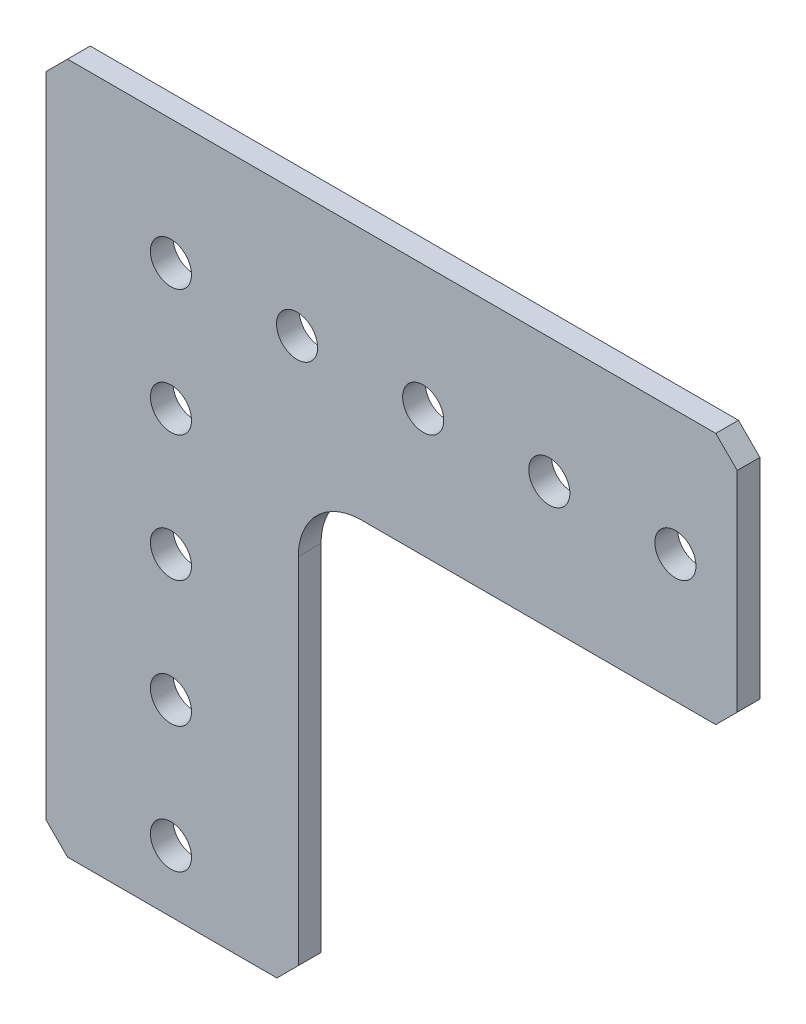
ISO-10303-21;
HEADER;
FILE_DESCRIPTION(('STEP AP214'),'2;1');
FILE_NAME('part.step','',(''),(''),'','','');
FILE_SCHEMA(('AUTOMOTIVE_DESIGN { 1 0 10303 214 1 1 1 1 }'));
ENDSEC;
DATA;
#1=APPLICATION_CONTEXT('core data for automotive mechanical design processes');
#2=APPLICATION_PROTOCOL_DEFINITION('international standard','automotive_design',2000,#1);
#3=PRODUCT_CONTEXT('',#1,'mechanical');
#4=PRODUCT('Part','Part','',(#3));
#5=PRODUCT_RELATED_PRODUCT_CATEGORY('part','',(#4));
#6=PRODUCT_DEFINITION_FORMATION('','',#4);
#7=PRODUCT_DEFINITION_CONTEXT('part definition',#1,'design');
#8=PRODUCT_DEFINITION('design','',#6,#7);
#9=PRODUCT_DEFINITION_SHAPE('','',#8);
#10=(LENGTH_UNIT() NAMED_UNIT(*) SI_UNIT(.MILLI.,.METRE.));
#11=(NAMED_UNIT(*) PLANE_ANGLE_UNIT() SI_UNIT($,.RADIAN.));
#12=(NAMED_UNIT(*) SI_UNIT($,.STERADIAN.) SOLID_ANGLE_UNIT());
#13=UNCERTAINTY_MEASURE_WITH_UNIT(LENGTH_MEASURE(1.E-05),#10,'distance_accuracy_value','');
#14=(GEOMETRIC_REPRESENTATION_CONTEXT(3) GLOBAL_UNCERTAINTY_ASSIGNED_CONTEXT((#13)) GLOBAL_UNIT_ASSIGNED_CONTEXT((#10,
#11,#12)) REPRESENTATION_CONTEXT('',''));
#15=CARTESIAN_POINT('',(0.,0.,0.));
#16=DIRECTION('',(0.,0.,1.));
#17=DIRECTION('',(1.,0.,0.));
#18=AXIS2_PLACEMENT_3D('',#15,#16,#17);
#19=CARTESIAN_POINT('',(-12.573,12.573,0.));
#20=DIRECTION('',(0.,0.,-1.));
#21=DIRECTION('',(-1.,0.,0.));
#22=AXIS2_PLACEMENT_3D('',#19,#20,#21);
#23=PLANE('',#22);
#24=DIRECTION('',(1.,0.,0.));
#25=VECTOR('',#24,1.);
#26=CARTESIAN_POINT('',(-12.573,12.573,0.));
#27=LINE('',#26,#25);
#28=CARTESIAN_POINT('',(-10.414,12.573,0.));
#29=VERTEX_POINT('',#28);
#30=CARTESIAN_POINT('',(54.864,12.573,0.));
#31=VERTEX_POINT('',#30);
#32=EDGE_CURVE('E144',#29,#31,#27,.T.);
#33=ORIENTED_EDGE('',*,*,#32,.T.);
#34=DIRECTION('',(0.707106781186549,-0.707106781186546,0.));
#35=VECTOR('',#34,1.);
#36=CARTESIAN_POINT('',(54.864,12.573,0.));
#37=LINE('',#36,#35);
#38=CARTESIAN_POINT('',(57.023,10.414,0.));
#39=VERTEX_POINT('',#38);
#40=EDGE_CURVE('E139',#31,#39,#37,.T.);
#41=ORIENTED_EDGE('',*,*,#40,.T.);
#42=DIRECTION('',(0.,-1.,0.));
#43=VECTOR('',#42,1.);
#44=CARTESIAN_POINT('',(57.023,12.573,0.));
#45=LINE('',#44,#43);
#46=CARTESIAN_POINT('',(57.023,-10.668,0.));
#47=VERTEX_POINT('',#46);
#48=EDGE_CURVE('E132',#39,#47,#45,.T.);
#49=ORIENTED_EDGE('',*,*,#48,.T.);
#50=DIRECTION('',(0.707106781186547,0.707106781186548,0.));
#51=VECTOR('',#50,1.);
#52=CARTESIAN_POINT('',(57.023,-10.668,0.));
#53=LINE('',#52,#51);
#54=CARTESIAN_POINT('',(54.864,-12.827,0.));
#55=VERTEX_POINT('',#54);
#56=EDGE_CURVE('E121',#55,#47,#53,.T.);
#57=ORIENTED_EDGE('',*,*,#56,.F.);
#58=DIRECTION('',(1.,0.,0.));
#59=VECTOR('',#58,1.);
#60=CARTESIAN_POINT('',(0.,-12.827,0.));
#61=LINE('',#60,#59);
#62=CARTESIAN_POINT('',(19.177,-12.827,0.));
#63=VERTEX_POINT('',#62);
#64=EDGE_CURVE('E115',#63,#55,#61,.T.);
#65=ORIENTED_EDGE('',*,*,#64,.F.);
#66=CARTESIAN_POINT('',(19.177,-19.177,0.));
#67=DIRECTION('',(0.,0.,1.));
#68=DIRECTION('',(1.,0.,0.));
#69=AXIS2_PLACEMENT_3D('',#66,#67,#68);
#70=CIRCLE('',#69,6.35);
#71=CARTESIAN_POINT('',(12.827,-19.177,0.));
#72=VERTEX_POINT('',#71);
#73=EDGE_CURVE('E103',#63,#72,#70,.T.);
#74=ORIENTED_EDGE('',*,*,#73,.T.);
#75=DIRECTION('',(0.,-1.,0.));
#76=VECTOR('',#75,1.);
#77=CARTESIAN_POINT('',(12.827,0.,0.));
#78=LINE('',#77,#76);
#79=CARTESIAN_POINT('',(12.827,-54.864,0.));
#80=VERTEX_POINT('',#79);
#81=EDGE_CURVE('E174',#72,#80,#78,.T.);
#82=ORIENTED_EDGE('',*,*,#81,.T.);
#83=DIRECTION('',(-0.707106781186547,-0.707106781186548,0.));
#84=VECTOR('',#83,1.);
#85=CARTESIAN_POINT('',(12.827,-54.864,0.));
#86=LINE('',#85,#84);
#87=CARTESIAN_POINT('',(10.668,-57.023,0.));
#88=VERTEX_POINT('',#87);
#89=EDGE_CURVE('E169',#80,#88,#86,.T.);
#90=ORIENTED_EDGE('',*,*,#89,.T.);
#91=DIRECTION('',(-1.,0.,0.));
#92=VECTOR('',#91,1.);
#93=CARTESIAN_POINT('',(12.827,-57.023,0.));
#94=LINE('',#93,#92);
#95=CARTESIAN_POINT('',(-10.414,-57.023,0.));
#96=VERTEX_POINT('',#95);
#97=EDGE_CURVE('E164',#88,#96,#94,.T.);
#98=ORIENTED_EDGE('',*,*,#97,.T.);
#99=DIRECTION('',(-0.707106781186548,0.707106781186548,0.));
#100=VECTOR('',#99,1.);
#101=CARTESIAN_POINT('',(-10.414,-57.023,0.));
#102=LINE('',#101,#100);
#103=CARTESIAN_POINT('',(-12.573,-54.864,0.));
#104=VERTEX_POINT('',#103);
#105=EDGE_CURVE('E159',#96,#104,#102,.T.);
#106=ORIENTED_EDGE('',*,*,#105,.T.);
#107=DIRECTION('',(0.,1.,0.));
#108=VECTOR('',#107,1.);
#109=CARTESIAN_POINT('',(-12.573,-57.023,0.));
#110=LINE('',#109,#108);
#111=CARTESIAN_POINT('',(-12.573,10.414,0.));
#112=VERTEX_POINT('',#111);
#113=EDGE_CURVE('E154',#104,#112,#110,.T.);
#114=ORIENTED_EDGE('',*,*,#113,.T.);
#115=DIRECTION('',(0.707106781186548,0.707106781186548,0.));
#116=VECTOR('',#115,1.);
#117=CARTESIAN_POINT('',(-12.573,10.414,0.));
#118=LINE('',#117,#116);
#119=EDGE_CURVE('E149',#112,#29,#118,.T.);
#120=ORIENTED_EDGE('',*,*,#119,.T.);
#121=EDGE_LOOP('',(#33,#41,#49,#57,#65,#74,#82,#90,#98,#106,#114,#120));
#122=FACE_BOUND('',#121,.T.);
#123=CARTESIAN_POINT('',(0.,-50.8,0.));
#124=DIRECTION('',(0.,0.,-1.));
#125=DIRECTION('',(-1.,0.,0.));
#126=AXIS2_PLACEMENT_3D('',#123,#124,#125);
#127=CIRCLE('',#126,2.0701);
#128=CARTESIAN_POINT('',(-2.07009999999999,-50.8,0.));
#129=VERTEX_POINT('',#128);
#130=EDGE_CURVE('E112',#129,#129,#127,.F.);
#131=ORIENTED_EDGE('',*,*,#130,.T.);
#132=EDGE_LOOP('',(#131));
#133=FACE_BOUND('',#132,.T.);
#134=CARTESIAN_POINT('',(2.66050878019847E-13,-25.4,0.));
#135=DIRECTION('',(0.,0.,-1.));
#136=DIRECTION('',(-1.,0.,0.));
#137=AXIS2_PLACEMENT_3D('',#134,#135,#136);
#138=CIRCLE('',#137,2.0701);
#139=CARTESIAN_POINT('',(-2.07009999999973,-25.4,0.));
#140=VERTEX_POINT('',#139);
#141=EDGE_CURVE('E209',#140,#140,#138,.F.);
#142=ORIENTED_EDGE('',*,*,#141,.T.);
#143=EDGE_LOOP('',(#142));
#144=FACE_BOUND('',#143,.T.);
#145=CARTESIAN_POINT('',(38.1,0.,0.));
#146=DIRECTION('',(0.,0.,-1.));
#147=DIRECTION('',(-1.,0.,0.));
#148=AXIS2_PLACEMENT_3D('',#145,#146,#147);
#149=CIRCLE('',#148,2.0701);
#150=CARTESIAN_POINT('',(36.0299,0.,0.));
#151=VERTEX_POINT('',#150);
#152=EDGE_CURVE('E212',#151,#151,#149,.F.);
#153=ORIENTED_EDGE('',*,*,#152,.T.);
#154=EDGE_LOOP('',(#153));
#155=FACE_BOUND('',#154,.T.);
#156=CARTESIAN_POINT('',(12.7,1.77367252013231E-13,0.));
#157=DIRECTION('',(0.,0.,-1.));
#158=DIRECTION('',(-1.,0.,0.));
#159=AXIS2_PLACEMENT_3D('',#156,#157,#158);
#160=CIRCLE('',#159,2.0701);
#161=CARTESIAN_POINT('',(10.6299,1.77367252013231E-13,0.));
#162=VERTEX_POINT('',#161);
#163=EDGE_CURVE('E215',#162,#162,#160,.F.);
#164=ORIENTED_EDGE('',*,*,#163,.T.);
#165=EDGE_LOOP('',(#164));
#166=FACE_BOUND('',#165,.T.);
#167=CARTESIAN_POINT('',(0.,0.,0.));
#168=DIRECTION('',(0.,0.,-1.));
#169=DIRECTION('',(-1.,0.,0.));
#170=AXIS2_PLACEMENT_3D('',#167,#168,#169);
#171=CIRCLE('',#170,2.0701);
#172=CARTESIAN_POINT('',(-2.0701,0.,0.));
#173=VERTEX_POINT('',#172);
#174=EDGE_CURVE('E218',#173,#173,#171,.F.);
#175=ORIENTED_EDGE('',*,*,#174,.T.);
#176=EDGE_LOOP('',(#175));
#177=FACE_BOUND('',#176,.T.);
#178=CARTESIAN_POINT('',(25.4,3.54734504026462E-13,0.));
#179=DIRECTION('',(0.,0.,-1.));
#180=DIRECTION('',(-1.,0.,0.));
#181=AXIS2_PLACEMENT_3D('',#178,#179,#180);
#182=CIRCLE('',#181,2.0701);
#183=CARTESIAN_POINT('',(23.3299,3.54734504026462E-13,0.));
#184=VERTEX_POINT('',#183);
#185=EDGE_CURVE('E221',#184,#184,#182,.F.);
#186=ORIENTED_EDGE('',*,*,#185,.T.);
#187=EDGE_LOOP('',(#186));
#188=FACE_BOUND('',#187,.T.);
#189=CARTESIAN_POINT('',(1.33025439009923E-13,-12.7,0.));
#190=DIRECTION('',(0.,0.,-1.));
#191=DIRECTION('',(-1.,0.,0.));
#192=AXIS2_PLACEMENT_3D('',#189,#190,#191);
#193=CIRCLE('',#192,2.0701);
#194=CARTESIAN_POINT('',(-2.07009999999987,-12.7,0.));
#195=VERTEX_POINT('',#194);
#196=EDGE_CURVE('E224',#195,#195,#193,.F.);
#197=ORIENTED_EDGE('',*,*,#196,.T.);
#198=EDGE_LOOP('',(#197));
#199=FACE_BOUND('',#198,.T.);
#200=CARTESIAN_POINT('',(3.9907631702977E-13,-38.1,0.));
#201=DIRECTION('',(0.,0.,-1.));
#202=DIRECTION('',(-1.,0.,0.));
#203=AXIS2_PLACEMENT_3D('',#200,#201,#202);
#204=CIRCLE('',#203,2.0701);
#205=CARTESIAN_POINT('',(-2.0700999999996,-38.1,0.));
#206=VERTEX_POINT('',#205);
#207=EDGE_CURVE('E226',#206,#206,#204,.F.);
#208=ORIENTED_EDGE('',*,*,#207,.T.);
#209=EDGE_LOOP('',(#208));
#210=FACE_BOUND('',#209,.T.);
#211=CARTESIAN_POINT('',(50.8,0.,0.));
#212=DIRECTION('',(0.,0.,-1.));
#213=DIRECTION('',(-1.,0.,0.));
#214=AXIS2_PLACEMENT_3D('',#211,#212,#213);
#215=CIRCLE('',#214,2.0701);
#216=CARTESIAN_POINT('',(48.7299,0.,0.));
#217=VERTEX_POINT('',#216);
#218=EDGE_CURVE('E20',#217,#217,#215,.F.);
#219=ORIENTED_EDGE('',*,*,#218,.T.);
#220=EDGE_LOOP('',(#219));
#221=FACE_BOUND('',#220,.T.);
#222=ADVANCED_FACE('F17',(#122,#133,#144,#155,#166,#177,#188,#199,#210,#221),#23,.T.);
#223=CARTESIAN_POINT('',(50.8,0.,2.286));
#224=DIRECTION('',(0.,0.,-1.));
#225=DIRECTION('',(-1.,0.,0.));
#226=AXIS2_PLACEMENT_3D('',#223,#224,#225);
#227=CYLINDRICAL_SURFACE('',#226,2.0701);
#228=ORIENTED_EDGE('',*,*,#218,.F.);
#229=EDGE_LOOP('',(#228));
#230=FACE_BOUND('',#229,.T.);
#231=CARTESIAN_POINT('',(50.8,0.,2.286));
#232=DIRECTION('',(0.,0.,-1.));
#233=DIRECTION('',(-1.,0.,0.));
#234=AXIS2_PLACEMENT_3D('',#231,#232,#233);
#235=CIRCLE('',#234,2.0701);
#236=CARTESIAN_POINT('',(48.7299,0.,2.286));
#237=VERTEX_POINT('',#236);
#238=EDGE_CURVE('E117',#237,#237,#235,.F.);
#239=ORIENTED_EDGE('',*,*,#238,.T.);
#240=EDGE_LOOP('',(#239));
#241=FACE_BOUND('',#240,.T.);
#242=ADVANCED_FACE('F234',(#230,#241),#227,.F.);
#243=CARTESIAN_POINT('',(3.9907631702977E-13,-38.1,2.286));
#244=DIRECTION('',(0.,0.,-1.));
#245=DIRECTION('',(-1.,0.,0.));
#246=AXIS2_PLACEMENT_3D('',#243,#244,#245);
#247=CYLINDRICAL_SURFACE('',#246,2.0701);
#248=ORIENTED_EDGE('',*,*,#207,.F.);
#249=EDGE_LOOP('',(#248));
#250=FACE_BOUND('',#249,.T.);
#251=CARTESIAN_POINT('',(3.9907631702977E-13,-38.1,2.286));
#252=DIRECTION('',(0.,0.,-1.));
#253=DIRECTION('',(-1.,0.,0.));
#254=AXIS2_PLACEMENT_3D('',#251,#252,#253);
#255=CIRCLE('',#254,2.0701);
#256=CARTESIAN_POINT('',(-2.0700999999996,-38.1,2.286));
#257=VERTEX_POINT('',#256);
#258=EDGE_CURVE('E202',#257,#257,#255,.F.);
#259=ORIENTED_EDGE('',*,*,#258,.T.);
#260=EDGE_LOOP('',(#259));
#261=FACE_BOUND('',#260,.T.);
#262=ADVANCED_FACE('F237',(#250,#261),#247,.F.);
#263=CARTESIAN_POINT('',(1.33025439009923E-13,-12.7,2.286));
#264=DIRECTION('',(0.,0.,-1.));
#265=DIRECTION('',(-1.,0.,0.));
#266=AXIS2_PLACEMENT_3D('',#263,#264,#265);
#267=CYLINDRICAL_SURFACE('',#266,2.0701);
#268=ORIENTED_EDGE('',*,*,#196,.F.);
#269=EDGE_LOOP('',(#268));
#270=FACE_BOUND('',#269,.T.);
#271=CARTESIAN_POINT('',(1.33025439009923E-13,-12.7,2.286));
#272=DIRECTION('',(0.,0.,-1.));
#273=DIRECTION('',(-1.,0.,0.));
#274=AXIS2_PLACEMENT_3D('',#271,#272,#273);
#275=CIRCLE('',#274,2.0701);
#276=CARTESIAN_POINT('',(-2.07009999999987,-12.7,2.286));
#277=VERTEX_POINT('',#276);
#278=EDGE_CURVE('E199',#277,#277,#275,.F.);
#279=ORIENTED_EDGE('',*,*,#278,.T.);
#280=EDGE_LOOP('',(#279));
#281=FACE_BOUND('',#280,.T.);
#282=ADVANCED_FACE('F317',(#270,#281),#267,.F.);
#283=CARTESIAN_POINT('',(25.4,3.54734504026462E-13,2.286));
#284=DIRECTION('',(0.,0.,-1.));
#285=DIRECTION('',(-1.,0.,0.));
#286=AXIS2_PLACEMENT_3D('',#283,#284,#285);
#287=CYLINDRICAL_SURFACE('',#286,2.0701);
#288=ORIENTED_EDGE('',*,*,#185,.F.);
#289=EDGE_LOOP('',(#288));
#290=FACE_BOUND('',#289,.T.);
#291=CARTESIAN_POINT('',(25.4,3.54734504026462E-13,2.286));
#292=DIRECTION('',(0.,0.,-1.));
#293=DIRECTION('',(-1.,0.,0.));
#294=AXIS2_PLACEMENT_3D('',#291,#292,#293);
#295=CIRCLE('',#294,2.0701);
#296=CARTESIAN_POINT('',(23.3299,3.54734504026462E-13,2.286));
#297=VERTEX_POINT('',#296);
#298=EDGE_CURVE('E196',#297,#297,#295,.F.);
#299=ORIENTED_EDGE('',*,*,#298,.T.);
#300=EDGE_LOOP('',(#299));
#301=FACE_BOUND('',#300,.T.);
#302=ADVANCED_FACE('F313',(#290,#301),#287,.F.);
#303=CARTESIAN_POINT('',(0.,0.,2.286));
#304=DIRECTION('',(0.,0.,-1.));
#305=DIRECTION('',(-1.,0.,0.));
#306=AXIS2_PLACEMENT_3D('',#303,#304,#305);
#307=CYLINDRICAL_SURFACE('',#306,2.0701);
#308=ORIENTED_EDGE('',*,*,#174,.F.);
#309=EDGE_LOOP('',(#308));
#310=FACE_BOUND('',#309,.T.);
#311=CARTESIAN_POINT('',(0.,0.,2.286));
#312=DIRECTION('',(0.,0.,-1.));
#313=DIRECTION('',(-1.,0.,0.));
#314=AXIS2_PLACEMENT_3D('',#311,#312,#313);
#315=CIRCLE('',#314,2.0701);
#316=CARTESIAN_POINT('',(-2.0701,0.,2.286));
#317=VERTEX_POINT('',#316);
#318=EDGE_CURVE('E193',#317,#317,#315,.F.);
#319=ORIENTED_EDGE('',*,*,#318,.T.);
#320=EDGE_LOOP('',(#319));
#321=FACE_BOUND('',#320,.T.);
#322=ADVANCED_FACE('F309',(#310,#321),#307,.F.);
#323=CARTESIAN_POINT('',(12.7,1.77367252013231E-13,2.286));
#324=DIRECTION('',(0.,0.,-1.));
#325=DIRECTION('',(-1.,0.,0.));
#326=AXIS2_PLACEMENT_3D('',#323,#324,#325);
#327=CYLINDRICAL_SURFACE('',#326,2.0701);
#328=ORIENTED_EDGE('',*,*,#163,.F.);
#329=EDGE_LOOP('',(#328));
#330=FACE_BOUND('',#329,.T.);
#331=CARTESIAN_POINT('',(12.7,1.77367252013231E-13,2.286));
#332=DIRECTION('',(0.,0.,-1.));
#333=DIRECTION('',(-1.,0.,0.));
#334=AXIS2_PLACEMENT_3D('',#331,#332,#333);
#335=CIRCLE('',#334,2.0701);
#336=CARTESIAN_POINT('',(10.6299,1.77367252013231E-13,2.286));
#337=VERTEX_POINT('',#336);
#338=EDGE_CURVE('E190',#337,#337,#335,.F.);
#339=ORIENTED_EDGE('',*,*,#338,.T.);
#340=EDGE_LOOP('',(#339));
#341=FACE_BOUND('',#340,.T.);
#342=ADVANCED_FACE('F305',(#330,#341),#327,.F.);
#343=CARTESIAN_POINT('',(38.1,0.,2.286));
#344=DIRECTION('',(0.,0.,-1.));
#345=DIRECTION('',(-1.,0.,0.));
#346=AXIS2_PLACEMENT_3D('',#343,#344,#345);
#347=CYLINDRICAL_SURFACE('',#346,2.0701);
#348=ORIENTED_EDGE('',*,*,#152,.F.);
#349=EDGE_LOOP('',(#348));
#350=FACE_BOUND('',#349,.T.);
#351=CARTESIAN_POINT('',(38.1,0.,2.286));
#352=DIRECTION('',(0.,0.,-1.));
#353=DIRECTION('',(-1.,0.,0.));
#354=AXIS2_PLACEMENT_3D('',#351,#352,#353);
#355=CIRCLE('',#354,2.0701);
#356=CARTESIAN_POINT('',(36.0299,0.,2.286));
#357=VERTEX_POINT('',#356);
#358=EDGE_CURVE('E187',#357,#357,#355,.F.);
#359=ORIENTED_EDGE('',*,*,#358,.T.);
#360=EDGE_LOOP('',(#359));
#361=FACE_BOUND('',#360,.T.);
#362=ADVANCED_FACE('F301',(#350,#361),#347,.F.);
#363=CARTESIAN_POINT('',(2.66050878019847E-13,-25.4,2.286));
#364=DIRECTION('',(0.,0.,-1.));
#365=DIRECTION('',(-1.,0.,0.));
#366=AXIS2_PLACEMENT_3D('',#363,#364,#365);
#367=CYLINDRICAL_SURFACE('',#366,2.0701);
#368=ORIENTED_EDGE('',*,*,#141,.F.);
#369=EDGE_LOOP('',(#368));
#370=FACE_BOUND('',#369,.T.);
#371=CARTESIAN_POINT('',(2.66050878019847E-13,-25.4,2.286));
#372=DIRECTION('',(0.,0.,-1.));
#373=DIRECTION('',(-1.,0.,0.));
#374=AXIS2_PLACEMENT_3D('',#371,#372,#373);
#375=CIRCLE('',#374,2.0701);
#376=CARTESIAN_POINT('',(-2.07009999999973,-25.4,2.286));
#377=VERTEX_POINT('',#376);
#378=EDGE_CURVE('E184',#377,#377,#375,.F.);
#379=ORIENTED_EDGE('',*,*,#378,.T.);
#380=EDGE_LOOP('',(#379));
#381=FACE_BOUND('',#380,.T.);
#382=ADVANCED_FACE('F297',(#370,#381),#367,.F.);
#383=CARTESIAN_POINT('',(0.,-50.8,2.286));
#384=DIRECTION('',(0.,0.,-1.));
#385=DIRECTION('',(-1.,0.,0.));
#386=AXIS2_PLACEMENT_3D('',#383,#384,#385);
#387=CYLINDRICAL_SURFACE('',#386,2.0701);
#388=ORIENTED_EDGE('',*,*,#130,.F.);
#389=EDGE_LOOP('',(#388));
#390=FACE_BOUND('',#389,.T.);
#391=CARTESIAN_POINT('',(0.,-50.8,2.286));
#392=DIRECTION('',(0.,0.,-1.));
#393=DIRECTION('',(-1.,0.,0.));
#394=AXIS2_PLACEMENT_3D('',#391,#392,#393);
#395=CIRCLE('',#394,2.0701);
#396=CARTESIAN_POINT('',(-2.07009999999999,-50.8,2.286));
#397=VERTEX_POINT('',#396);
#398=EDGE_CURVE('E181',#397,#397,#395,.F.);
#399=ORIENTED_EDGE('',*,*,#398,.T.);
#400=EDGE_LOOP('',(#399));
#401=FACE_BOUND('',#400,.T.);
#402=ADVANCED_FACE('F294',(#390,#401),#387,.F.);
#403=CARTESIAN_POINT('',(19.177,-19.177,0.));
#404=DIRECTION('',(0.,0.,1.));
#405=DIRECTION('',(1.,0.,0.));
#406=AXIS2_PLACEMENT_3D('',#403,#404,#405);
#407=CYLINDRICAL_SURFACE('',#406,6.35);
#408=DIRECTION('',(0.,0.,1.));
#409=VECTOR('',#408,1.);
#410=CARTESIAN_POINT('',(12.827,-19.177,0.));
#411=LINE('',#410,#409);
#412=CARTESIAN_POINT('',(12.827,-19.177,2.286));
#413=VERTEX_POINT('',#412);
#414=EDGE_CURVE('E108',#413,#72,#411,.F.);
#415=ORIENTED_EDGE('',*,*,#414,.T.);
#416=ORIENTED_EDGE('',*,*,#73,.F.);
#417=DIRECTION('',(0.,0.,-1.));
#418=VECTOR('',#417,1.);
#419=CARTESIAN_POINT('',(19.177,-12.827,0.));
#420=LINE('',#419,#418);
#421=CARTESIAN_POINT('',(19.177,-12.827,2.286));
#422=VERTEX_POINT('',#421);
#423=EDGE_CURVE('E107',#422,#63,#420,.T.);
#424=ORIENTED_EDGE('',*,*,#423,.F.);
#425=CARTESIAN_POINT('',(19.177,-19.177,2.286));
#426=DIRECTION('',(0.,0.,1.));
#427=DIRECTION('',(1.,0.,0.));
#428=AXIS2_PLACEMENT_3D('',#425,#426,#427);
#429=CIRCLE('',#428,6.35);
#430=EDGE_CURVE('E178',#422,#413,#429,.T.);
#431=ORIENTED_EDGE('',*,*,#430,.T.);
#432=EDGE_LOOP('',(#415,#416,#424,#431));
#433=FACE_BOUND('',#432,.T.);
#434=ADVANCED_FACE('F105',(#433),#407,.F.);
#435=CARTESIAN_POINT('',(12.827,0.,0.));
#436=DIRECTION('',(-1.,0.,0.));
#437=DIRECTION('',(0.,-1.,0.));
#438=AXIS2_PLACEMENT_3D('',#435,#436,#437);
#439=PLANE('',#438);
#440=DIRECTION('',(0.,0.,1.));
#441=VECTOR('',#440,1.);
#442=CARTESIAN_POINT('',(12.827,-54.864,0.));
#443=LINE('',#442,#441);
#444=CARTESIAN_POINT('',(12.827,-54.864,2.286));
#445=VERTEX_POINT('',#444);
#446=EDGE_CURVE('E171',#445,#80,#443,.F.);
#447=ORIENTED_EDGE('',*,*,#446,.T.);
#448=ORIENTED_EDGE('',*,*,#81,.F.);
#449=ORIENTED_EDGE('',*,*,#414,.F.);
#450=DIRECTION('',(0.,1.,0.));
#451=VECTOR('',#450,1.);
#452=CARTESIAN_POINT('',(12.827,12.573,2.286));
#453=LINE('',#452,#451);
#454=EDGE_CURVE('E180',#413,#445,#453,.F.);
#455=ORIENTED_EDGE('',*,*,#454,.T.);
#456=EDGE_LOOP('',(#447,#448,#449,#455));
#457=FACE_BOUND('',#456,.T.);
#458=ADVANCED_FACE('F287',(#457),#439,.F.);
#459=CARTESIAN_POINT('',(12.827,-54.864,0.));
#460=DIRECTION('',(-0.707106781186548,0.707106781186547,0.));
#461=DIRECTION('',(-0.707106781186547,-0.707106781186548,0.));
#462=AXIS2_PLACEMENT_3D('',#459,#460,#461);
#463=PLANE('',#462);
#464=DIRECTION('',(0.,0.,1.));
#465=VECTOR('',#464,1.);
#466=CARTESIAN_POINT('',(10.668,-57.023,2.286));
#467=LINE('',#466,#465);
#468=CARTESIAN_POINT('',(10.668,-57.023,2.286));
#469=VERTEX_POINT('',#468);
#470=EDGE_CURVE('E166',#469,#88,#467,.F.);
#471=ORIENTED_EDGE('',*,*,#470,.T.);
#472=ORIENTED_EDGE('',*,*,#89,.F.);
#473=ORIENTED_EDGE('',*,*,#446,.F.);
#474=DIRECTION('',(-0.70710678118655,-0.707106781186545,0.));
#475=VECTOR('',#474,1.);
#476=CARTESIAN_POINT('',(12.827,-54.864,2.286));
#477=LINE('',#476,#475);
#478=EDGE_CURVE('E554',#445,#469,#477,.T.);
#479=ORIENTED_EDGE('',*,*,#478,.T.);
#480=EDGE_LOOP('',(#471,#472,#473,#479));
#481=FACE_BOUND('',#480,.T.);
#482=ADVANCED_FACE('F283',(#481),#463,.F.);
#483=CARTESIAN_POINT('',(12.827,-57.023,2.286));
#484=DIRECTION('',(0.,1.,0.));
#485=DIRECTION('',(-1.,0.,0.));
#486=AXIS2_PLACEMENT_3D('',#483,#484,#485);
#487=PLANE('',#486);
#488=ORIENTED_EDGE('',*,*,#470,.F.);
#489=DIRECTION('',(-1.,0.,0.));
#490=VECTOR('',#489,1.);
#491=CARTESIAN_POINT('',(-12.573,-57.023,2.286));
#492=LINE('',#491,#490);
#493=CARTESIAN_POINT('',(-10.414,-57.023,2.286));
#494=VERTEX_POINT('',#493);
#495=EDGE_CURVE('E556',#469,#494,#492,.T.);
#496=ORIENTED_EDGE('',*,*,#495,.T.);
#497=DIRECTION('',(0.,0.,1.));
#498=VECTOR('',#497,1.);
#499=CARTESIAN_POINT('',(-10.414,-57.023,2.286));
#500=LINE('',#499,#498);
#501=EDGE_CURVE('E161',#494,#96,#500,.F.);
#502=ORIENTED_EDGE('',*,*,#501,.T.);
#503=ORIENTED_EDGE('',*,*,#97,.F.);
#504=EDGE_LOOP('',(#488,#496,#502,#503));
#505=FACE_BOUND('',#504,.T.);
#506=ADVANCED_FACE('F279',(#505),#487,.F.);
#507=CARTESIAN_POINT('',(-10.414,-57.023,2.286));
#508=DIRECTION('',(0.707106781186548,0.707106781186548,0.));
#509=DIRECTION('',(-0.707106781186548,0.707106781186548,0.));
#510=AXIS2_PLACEMENT_3D('',#507,#508,#509);
#511=PLANE('',#510);
#512=DIRECTION('',(0.,0.,1.));
#513=VECTOR('',#512,1.);
#514=CARTESIAN_POINT('',(-12.573,-54.864,2.286));
#515=LINE('',#514,#513);
#516=CARTESIAN_POINT('',(-12.573,-54.864,2.286));
#517=VERTEX_POINT('',#516);
#518=EDGE_CURVE('E156',#517,#104,#515,.F.);
#519=ORIENTED_EDGE('',*,*,#518,.T.);
#520=ORIENTED_EDGE('',*,*,#105,.F.);
#521=ORIENTED_EDGE('',*,*,#501,.F.);
#522=DIRECTION('',(-0.707106781186547,0.707106781186548,0.));
#523=VECTOR('',#522,1.);
#524=CARTESIAN_POINT('',(-10.414,-57.023,2.286));
#525=LINE('',#524,#523);
#526=EDGE_CURVE('E565',#494,#517,#525,.T.);
#527=ORIENTED_EDGE('',*,*,#526,.T.);
#528=EDGE_LOOP('',(#519,#520,#521,#527));
#529=FACE_BOUND('',#528,.T.);
#530=ADVANCED_FACE('F275',(#529),#511,.F.);
#531=CARTESIAN_POINT('',(-12.573,-57.023,2.286));
#532=DIRECTION('',(1.,0.,0.));
#533=DIRECTION('',(0.,1.,0.));
#534=AXIS2_PLACEMENT_3D('',#531,#532,#533);
#535=PLANE('',#534);
#536=ORIENTED_EDGE('',*,*,#518,.F.);
#537=DIRECTION('',(0.,1.,0.));
#538=VECTOR('',#537,1.);
#539=CARTESIAN_POINT('',(-12.573,12.573,2.286));
#540=LINE('',#539,#538);
#541=CARTESIAN_POINT('',(-12.573,10.414,2.286));
#542=VERTEX_POINT('',#541);
#543=EDGE_CURVE('E574',#517,#542,#540,.T.);
#544=ORIENTED_EDGE('',*,*,#543,.T.);
#545=DIRECTION('',(0.,0.,1.));
#546=VECTOR('',#545,1.);
#547=CARTESIAN_POINT('',(-12.573,10.414,2.286));
#548=LINE('',#547,#546);
#549=EDGE_CURVE('E151',#542,#112,#548,.F.);
#550=ORIENTED_EDGE('',*,*,#549,.T.);
#551=ORIENTED_EDGE('',*,*,#113,.F.);
#552=EDGE_LOOP('',(#536,#544,#550,#551));
#553=FACE_BOUND('',#552,.T.);
#554=ADVANCED_FACE('F271',(#553),#535,.F.);
#555=CARTESIAN_POINT('',(-12.573,10.414,2.286));
#556=DIRECTION('',(0.707106781186548,-0.707106781186548,0.));
#557=DIRECTION('',(0.707106781186548,0.707106781186548,0.));
#558=AXIS2_PLACEMENT_3D('',#555,#556,#557);
#559=PLANE('',#558);
#560=DIRECTION('',(0.,0.,-1.));
#561=VECTOR('',#560,1.);
#562=CARTESIAN_POINT('',(-10.414,12.573,2.286));
#563=LINE('',#562,#561);
#564=CARTESIAN_POINT('',(-10.414,12.573,2.286));
#565=VERTEX_POINT('',#564);
#566=EDGE_CURVE('E146',#565,#29,#563,.T.);
#567=ORIENTED_EDGE('',*,*,#566,.T.);
#568=ORIENTED_EDGE('',*,*,#119,.F.);
#569=ORIENTED_EDGE('',*,*,#549,.F.);
#570=DIRECTION('',(0.707106781186545,0.70710678118655,0.));
#571=VECTOR('',#570,1.);
#572=CARTESIAN_POINT('',(-12.573,10.414,2.286));
#573=LINE('',#572,#571);
#574=EDGE_CURVE('E583',#542,#565,#573,.T.);
#575=ORIENTED_EDGE('',*,*,#574,.T.);
#576=EDGE_LOOP('',(#567,#568,#569,#575));
#577=FACE_BOUND('',#576,.T.);
#578=ADVANCED_FACE('F267',(#577),#559,.F.);
#579=CARTESIAN_POINT('',(-12.573,12.573,2.286));
#580=DIRECTION('',(0.,-1.,0.));
#581=DIRECTION('',(0.,0.,-1.));
#582=AXIS2_PLACEMENT_3D('',#579,#580,#581);
#583=PLANE('',#582);
#584=ORIENTED_EDGE('',*,*,#566,.F.);
#585=DIRECTION('',(-1.,0.,0.));
#586=VECTOR('',#585,1.);
#587=CARTESIAN_POINT('',(-12.573,12.573,2.286));
#588=LINE('',#587,#586);
#589=CARTESIAN_POINT('',(54.864,12.573,2.286));
#590=VERTEX_POINT('',#589);
#591=EDGE_CURVE('E592',#565,#590,#588,.F.);
#592=ORIENTED_EDGE('',*,*,#591,.T.);
#593=DIRECTION('',(0.,0.,1.));
#594=VECTOR('',#593,1.);
#595=CARTESIAN_POINT('',(54.864,12.573,2.286));
#596=LINE('',#595,#594);
#597=EDGE_CURVE('E141',#590,#31,#596,.F.);
#598=ORIENTED_EDGE('',*,*,#597,.T.);
#599=ORIENTED_EDGE('',*,*,#32,.F.);
#600=EDGE_LOOP('',(#584,#592,#598,#599));
#601=FACE_BOUND('',#600,.T.);
#602=ADVANCED_FACE('F263',(#601),#583,.F.);
#603=CARTESIAN_POINT('',(54.864,12.573,2.286));
#604=DIRECTION('',(-0.707106781186546,-0.707106781186549,0.));
#605=DIRECTION('',(0.707106781186549,-0.707106781186546,0.));
#606=AXIS2_PLACEMENT_3D('',#603,#604,#605);
#607=PLANE('',#606);
#608=DIRECTION('',(0.,0.,1.));
#609=VECTOR('',#608,1.);
#610=CARTESIAN_POINT('',(57.023,10.414,2.286));
#611=LINE('',#610,#609);
#612=CARTESIAN_POINT('',(57.023,10.414,2.286));
#613=VERTEX_POINT('',#612);
#614=EDGE_CURVE('E136',#613,#39,#611,.F.);
#615=ORIENTED_EDGE('',*,*,#614,.T.);
#616=ORIENTED_EDGE('',*,*,#40,.F.);
#617=ORIENTED_EDGE('',*,*,#597,.F.);
#618=DIRECTION('',(0.707106781186551,-0.707106781186544,0.));
#619=VECTOR('',#618,1.);
#620=CARTESIAN_POINT('',(54.864,12.573,2.286));
#621=LINE('',#620,#619);
#622=EDGE_CURVE('E601',#590,#613,#621,.T.);
#623=ORIENTED_EDGE('',*,*,#622,.T.);
#624=EDGE_LOOP('',(#615,#616,#617,#623));
#625=FACE_BOUND('',#624,.T.);
#626=ADVANCED_FACE('F259',(#625),#607,.F.);
#627=CARTESIAN_POINT('',(57.023,12.573,2.286));
#628=DIRECTION('',(-1.,0.,0.));
#629=DIRECTION('',(0.,-1.,0.));
#630=AXIS2_PLACEMENT_3D('',#627,#628,#629);
#631=PLANE('',#630);
#632=DIRECTION('',(0.,0.,1.));
#633=VECTOR('',#632,1.);
#634=CARTESIAN_POINT('',(57.023,-10.668,2.286));
#635=LINE('',#634,#633);
#636=CARTESIAN_POINT('',(57.023,-10.668,2.286));
#637=VERTEX_POINT('',#636);
#638=EDGE_CURVE('E122',#47,#637,#635,.T.);
#639=ORIENTED_EDGE('',*,*,#638,.F.);
#640=ORIENTED_EDGE('',*,*,#48,.F.);
#641=ORIENTED_EDGE('',*,*,#614,.F.);
#642=DIRECTION('',(0.,1.,0.));
#643=VECTOR('',#642,1.);
#644=CARTESIAN_POINT('',(57.023,12.573,2.286));
#645=LINE('',#644,#643);
#646=EDGE_CURVE('E610',#613,#637,#645,.F.);
#647=ORIENTED_EDGE('',*,*,#646,.T.);
#648=EDGE_LOOP('',(#639,#640,#641,#647));
#649=FACE_BOUND('',#648,.T.);
#650=ADVANCED_FACE('F255',(#649),#631,.F.);
#651=CARTESIAN_POINT('',(57.023,-10.668,2.286));
#652=DIRECTION('',(0.707106781186548,-0.707106781186547,0.));
#653=DIRECTION('',(0.707106781186547,0.707106781186548,0.));
#654=AXIS2_PLACEMENT_3D('',#651,#652,#653);
#655=PLANE('',#654);
#656=ORIENTED_EDGE('',*,*,#56,.T.);
#657=ORIENTED_EDGE('',*,*,#638,.T.);
#658=DIRECTION('',(-0.707106781186544,-0.707106781186551,0.));
#659=VECTOR('',#658,1.);
#660=CARTESIAN_POINT('',(57.023,-10.668,2.286));
#661=LINE('',#660,#659);
#662=CARTESIAN_POINT('',(54.864,-12.827,2.286));
#663=VERTEX_POINT('',#662);
#664=EDGE_CURVE('E26',#637,#663,#661,.T.);
#665=ORIENTED_EDGE('',*,*,#664,.T.);
#666=DIRECTION('',(0.,0.,-1.));
#667=VECTOR('',#666,1.);
#668=CARTESIAN_POINT('',(54.864,-12.827,0.));
#669=LINE('',#668,#667);
#670=EDGE_CURVE('E34',#55,#663,#669,.F.);
#671=ORIENTED_EDGE('',*,*,#670,.F.);
#672=EDGE_LOOP('',(#656,#657,#665,#671));
#673=FACE_BOUND('',#672,.T.);
#674=ADVANCED_FACE('F248',(#673),#655,.T.);
#675=CARTESIAN_POINT('',(0.,-12.827,0.));
#676=DIRECTION('',(0.,-1.,0.));
#677=DIRECTION('',(0.,0.,-1.));
#678=AXIS2_PLACEMENT_3D('',#675,#676,#677);
#679=PLANE('',#678);
#680=DIRECTION('',(-1.,0.,0.));
#681=VECTOR('',#680,1.);
#682=CARTESIAN_POINT('',(-12.573,-12.827,2.286));
#683=LINE('',#682,#681);
#684=EDGE_CURVE('E11',#663,#422,#683,.T.);
#685=ORIENTED_EDGE('',*,*,#684,.T.);
#686=ORIENTED_EDGE('',*,*,#423,.T.);
#687=ORIENTED_EDGE('',*,*,#64,.T.);
#688=ORIENTED_EDGE('',*,*,#670,.T.);
#689=EDGE_LOOP('',(#685,#686,#687,#688));
#690=FACE_BOUND('',#689,.T.);
#691=ADVANCED_FACE('F114',(#690),#679,.T.);
#692=CARTESIAN_POINT('',(-12.573,12.573,2.286));
#693=DIRECTION('',(0.,0.,-1.));
#694=DIRECTION('',(-1.,0.,0.));
#695=AXIS2_PLACEMENT_3D('',#692,#693,#694);
#696=PLANE('',#695);
#697=ORIENTED_EDGE('',*,*,#664,.F.);
#698=ORIENTED_EDGE('',*,*,#646,.F.);
#699=ORIENTED_EDGE('',*,*,#622,.F.);
#700=ORIENTED_EDGE('',*,*,#591,.F.);
#701=ORIENTED_EDGE('',*,*,#574,.F.);
#702=ORIENTED_EDGE('',*,*,#543,.F.);
#703=ORIENTED_EDGE('',*,*,#526,.F.);
#704=ORIENTED_EDGE('',*,*,#495,.F.);
#705=ORIENTED_EDGE('',*,*,#478,.F.);
#706=ORIENTED_EDGE('',*,*,#454,.F.);
#707=ORIENTED_EDGE('',*,*,#430,.F.);
#708=ORIENTED_EDGE('',*,*,#684,.F.);
#709=EDGE_LOOP('',(#697,#698,#699,#700,#701,#702,#703,#704,#705,#706,#707,#708));
#710=FACE_BOUND('',#709,.T.);
#711=ORIENTED_EDGE('',*,*,#398,.F.);
#712=EDGE_LOOP('',(#711));
#713=FACE_BOUND('',#712,.T.);
#714=ORIENTED_EDGE('',*,*,#378,.F.);
#715=EDGE_LOOP('',(#714));
#716=FACE_BOUND('',#715,.T.);
#717=ORIENTED_EDGE('',*,*,#358,.F.);
#718=EDGE_LOOP('',(#717));
#719=FACE_BOUND('',#718,.T.);
#720=ORIENTED_EDGE('',*,*,#338,.F.);
#721=EDGE_LOOP('',(#720));
#722=FACE_BOUND('',#721,.T.);
#723=ORIENTED_EDGE('',*,*,#318,.F.);
#724=EDGE_LOOP('',(#723));
#725=FACE_BOUND('',#724,.T.);
#726=ORIENTED_EDGE('',*,*,#298,.F.);
#727=EDGE_LOOP('',(#726));
#728=FACE_BOUND('',#727,.T.);
#729=ORIENTED_EDGE('',*,*,#278,.F.);
#730=EDGE_LOOP('',(#729));
#731=FACE_BOUND('',#730,.T.);
#732=ORIENTED_EDGE('',*,*,#258,.F.);
#733=EDGE_LOOP('',(#732));
#734=FACE_BOUND('',#733,.T.);
#735=ORIENTED_EDGE('',*,*,#238,.F.);
#736=EDGE_LOOP('',(#735));
#737=FACE_BOUND('',#736,.T.);
#738=ADVANCED_FACE('F240',(#710,#713,#716,#719,#722,#725,#728,#731,#734,#737),#696,.F.);
#739=CLOSED_SHELL('',(#222,#242,#262,#282,#302,#322,#342,#362,#382,#402,#434,#458,#482,#506,
#530,#554,#578,#602,#626,#650,#674,#691,#738));
#740=MANIFOLD_SOLID_BREP('B1',#739);
#741=ADVANCED_BREP_SHAPE_REPRESENTATION('',(#18,#740),#14);
#742=SHAPE_DEFINITION_REPRESENTATION(#9,#741);
ENDSEC;
END-ISO-10303-21;
